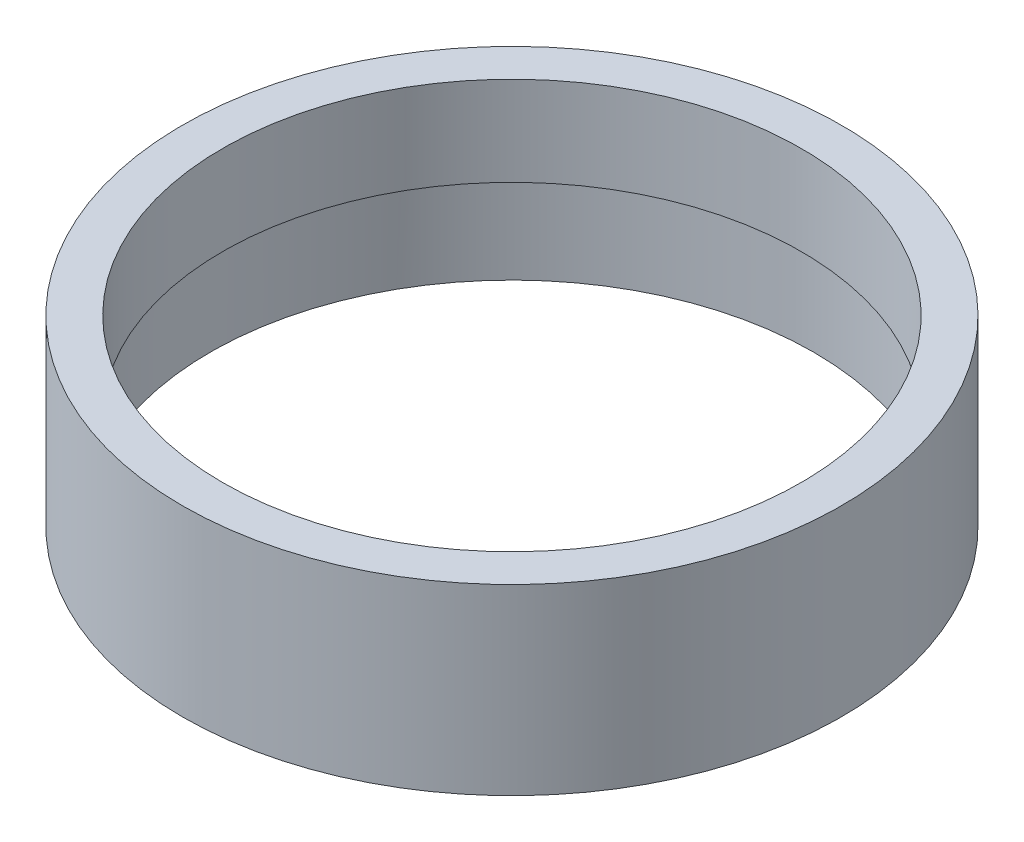
ISO-10303-21;
HEADER;
FILE_DESCRIPTION(('STEP AP214'),'2;1');
FILE_NAME('part.step','',(''),(''),'','','');
FILE_SCHEMA(('AUTOMOTIVE_DESIGN { 1 0 10303 214 1 1 1 1 }'));
ENDSEC;
DATA;
#1=APPLICATION_CONTEXT('core data for automotive mechanical design processes');
#2=APPLICATION_PROTOCOL_DEFINITION('international standard','automotive_design',2000,#1);
#3=PRODUCT_CONTEXT('',#1,'mechanical');
#4=PRODUCT('Part','Part','',(#3));
#5=PRODUCT_RELATED_PRODUCT_CATEGORY('part','',(#4));
#6=PRODUCT_DEFINITION_FORMATION('','',#4);
#7=PRODUCT_DEFINITION_CONTEXT('part definition',#1,'design');
#8=PRODUCT_DEFINITION('design','',#6,#7);
#9=PRODUCT_DEFINITION_SHAPE('','',#8);
#10=(LENGTH_UNIT() NAMED_UNIT(*) SI_UNIT(.MILLI.,.METRE.));
#11=(NAMED_UNIT(*) PLANE_ANGLE_UNIT() SI_UNIT($,.RADIAN.));
#12=(NAMED_UNIT(*) SI_UNIT($,.STERADIAN.) SOLID_ANGLE_UNIT());
#13=UNCERTAINTY_MEASURE_WITH_UNIT(LENGTH_MEASURE(1.E-05),#10,'distance_accuracy_value','');
#14=(GEOMETRIC_REPRESENTATION_CONTEXT(3) GLOBAL_UNCERTAINTY_ASSIGNED_CONTEXT((#13)) GLOBAL_UNIT_ASSIGNED_CONTEXT((#10,
#11,#12)) REPRESENTATION_CONTEXT('',''));
#15=CARTESIAN_POINT('',(0.,0.,0.));
#16=DIRECTION('',(0.,0.,1.));
#17=DIRECTION('',(1.,0.,0.));
#18=AXIS2_PLACEMENT_3D('',#15,#16,#17);
#19=CARTESIAN_POINT('',(0.,43.,0.));
#20=DIRECTION('',(0.,-1.,0.));
#21=DIRECTION('',(0.,0.,-1.));
#22=AXIS2_PLACEMENT_3D('',#19,#20,#21);
#23=CYLINDRICAL_SURFACE('',#22,71.);
#24=CARTESIAN_POINT('',(0.,0.,0.));
#25=DIRECTION('',(0.,-1.,0.));
#26=DIRECTION('',(0.,0.,-1.));
#27=AXIS2_PLACEMENT_3D('',#24,#25,#26);
#28=CIRCLE('',#27,71.);
#29=CARTESIAN_POINT('',(0.,0.,-71.));
#30=VERTEX_POINT('',#29);
#31=EDGE_CURVE('E52',#30,#30,#28,.T.);
#32=ORIENTED_EDGE('',*,*,#31,.T.);
#33=EDGE_LOOP('',(#32));
#34=FACE_BOUND('',#33,.T.);
#35=CARTESIAN_POINT('',(0.,22.,0.));
#36=DIRECTION('',(0.,1.,0.));
#37=DIRECTION('',(0.,0.,1.));
#38=AXIS2_PLACEMENT_3D('',#35,#36,#37);
#39=CIRCLE('',#38,71.);
#40=CARTESIAN_POINT('',(0.,22.,71.));
#41=VERTEX_POINT('',#40);
#42=EDGE_CURVE('E10',#41,#41,#39,.F.);
#43=ORIENTED_EDGE('',*,*,#42,.F.);
#44=EDGE_LOOP('',(#43));
#45=FACE_BOUND('',#44,.T.);
#46=ADVANCED_FACE('F36',(#34,#45),#23,.F.);
#47=CARTESIAN_POINT('',(0.,43.,0.));
#48=DIRECTION('',(0.,-1.,0.));
#49=DIRECTION('',(0.,0.,-1.));
#50=AXIS2_PLACEMENT_3D('',#47,#48,#49);
#51=CYLINDRICAL_SURFACE('',#50,77.5);
#52=CARTESIAN_POINT('',(0.,43.,0.));
#53=DIRECTION('',(0.,1.,0.));
#54=DIRECTION('',(0.,0.,1.));
#55=AXIS2_PLACEMENT_3D('',#52,#53,#54);
#56=CIRCLE('',#55,77.5);
#57=CARTESIAN_POINT('',(0.,43.,77.5));
#58=VERTEX_POINT('',#57);
#59=EDGE_CURVE('E43',#58,#58,#56,.T.);
#60=ORIENTED_EDGE('',*,*,#59,.F.);
#61=EDGE_LOOP('',(#60));
#62=FACE_BOUND('',#61,.T.);
#63=CARTESIAN_POINT('',(0.,0.,0.));
#64=DIRECTION('',(0.,1.,0.));
#65=DIRECTION('',(0.,0.,1.));
#66=AXIS2_PLACEMENT_3D('',#63,#64,#65);
#67=CIRCLE('',#66,77.5);
#68=CARTESIAN_POINT('',(0.,0.,77.5));
#69=VERTEX_POINT('',#68);
#70=EDGE_CURVE('E47',#69,#69,#67,.T.);
#71=ORIENTED_EDGE('',*,*,#70,.T.);
#72=EDGE_LOOP('',(#71));
#73=FACE_BOUND('',#72,.T.);
#74=ADVANCED_FACE('F38',(#62,#73),#51,.T.);
#75=CARTESIAN_POINT('',(0.,43.,0.));
#76=DIRECTION('',(0.,1.,0.));
#77=DIRECTION('',(0.,0.,1.));
#78=AXIS2_PLACEMENT_3D('',#75,#76,#77);
#79=PLANE('',#78);
#80=ORIENTED_EDGE('',*,*,#59,.T.);
#81=EDGE_LOOP('',(#80));
#82=FACE_BOUND('',#81,.T.);
#83=CARTESIAN_POINT('',(0.,43.,0.));
#84=DIRECTION('',(0.,1.,0.));
#85=DIRECTION('',(0.,0.,1.));
#86=AXIS2_PLACEMENT_3D('',#83,#84,#85);
#87=CIRCLE('',#86,68.0442938344696);
#88=CARTESIAN_POINT('',(0.,43.,68.0442938344696));
#89=VERTEX_POINT('',#88);
#90=EDGE_CURVE('E56',#89,#89,#87,.T.);
#91=ORIENTED_EDGE('',*,*,#90,.F.);
#92=EDGE_LOOP('',(#91));
#93=FACE_BOUND('',#92,.T.);
#94=ADVANCED_FACE('F66',(#82,#93),#79,.T.);
#95=CARTESIAN_POINT('',(0.,0.,0.));
#96=DIRECTION('',(0.,1.,0.));
#97=DIRECTION('',(0.,0.,1.));
#98=AXIS2_PLACEMENT_3D('',#95,#96,#97);
#99=PLANE('',#98);
#100=ORIENTED_EDGE('',*,*,#31,.F.);
#101=EDGE_LOOP('',(#100));
#102=FACE_BOUND('',#101,.T.);
#103=ORIENTED_EDGE('',*,*,#70,.F.);
#104=EDGE_LOOP('',(#103));
#105=FACE_BOUND('',#104,.T.);
#106=ADVANCED_FACE('F68',(#102,#105),#99,.F.);
#107=CARTESIAN_POINT('',(0.,22.,0.));
#108=DIRECTION('',(0.,1.,0.));
#109=DIRECTION('',(0.,0.,1.));
#110=AXIS2_PLACEMENT_3D('',#107,#108,#109);
#111=PLANE('',#110);
#112=ORIENTED_EDGE('',*,*,#42,.T.);
#113=EDGE_LOOP('',(#112));
#114=FACE_BOUND('',#113,.T.);
#115=CARTESIAN_POINT('',(0.,22.,0.));
#116=DIRECTION('',(0.,1.,0.));
#117=DIRECTION('',(0.,0.,1.));
#118=AXIS2_PLACEMENT_3D('',#115,#116,#117);
#119=CIRCLE('',#118,68.0442938344696);
#120=CARTESIAN_POINT('',(0.,22.,68.0442938344696));
#121=VERTEX_POINT('',#120);
#122=EDGE_CURVE('E57',#121,#121,#119,.T.);
#123=ORIENTED_EDGE('',*,*,#122,.T.);
#124=EDGE_LOOP('',(#123));
#125=FACE_BOUND('',#124,.T.);
#126=ADVANCED_FACE('F74',(#114,#125),#111,.F.);
#127=CARTESIAN_POINT('',(0.,43.,0.));
#128=DIRECTION('',(0.,-1.,0.));
#129=DIRECTION('',(0.,0.,-1.));
#130=AXIS2_PLACEMENT_3D('',#127,#128,#129);
#131=CYLINDRICAL_SURFACE('',#130,68.0442938344696);
#132=ORIENTED_EDGE('',*,*,#90,.T.);
#133=EDGE_LOOP('',(#132));
#134=FACE_BOUND('',#133,.T.);
#135=ORIENTED_EDGE('',*,*,#122,.F.);
#136=EDGE_LOOP('',(#135));
#137=FACE_BOUND('',#136,.T.);
#138=ADVANCED_FACE('F63',(#134,#137),#131,.F.);
#139=CLOSED_SHELL('',(#46,#74,#94,#106,#126,#138));
#140=MANIFOLD_SOLID_BREP('B2',#139);
#141=ADVANCED_BREP_SHAPE_REPRESENTATION('',(#18,#140),#14);
#142=SHAPE_DEFINITION_REPRESENTATION(#9,#141);
ENDSEC;
END-ISO-10303-21;
